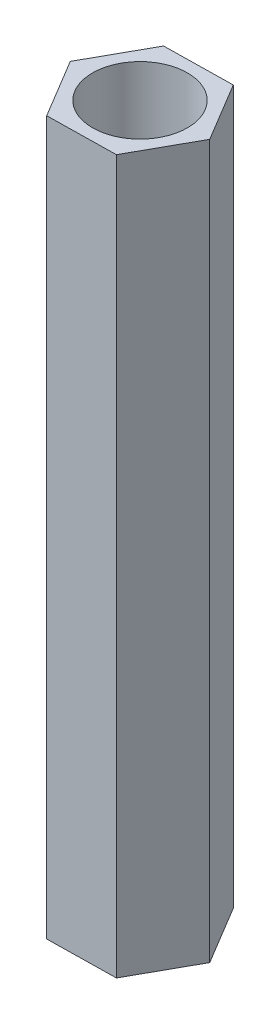
ISO-10303-21;
HEADER;
FILE_DESCRIPTION(('STEP AP214'),'2;1');
FILE_NAME('part.step','',(''),(''),'','','');
FILE_SCHEMA(('AUTOMOTIVE_DESIGN { 1 0 10303 214 1 1 1 1 }'));
ENDSEC;
DATA;
#1=APPLICATION_CONTEXT('core data for automotive mechanical design processes');
#2=APPLICATION_PROTOCOL_DEFINITION('international standard','automotive_design',2000,#1);
#3=PRODUCT_CONTEXT('',#1,'mechanical');
#4=PRODUCT('Part','Part','',(#3));
#5=PRODUCT_RELATED_PRODUCT_CATEGORY('part','',(#4));
#6=PRODUCT_DEFINITION_FORMATION('','',#4);
#7=PRODUCT_DEFINITION_CONTEXT('part definition',#1,'design');
#8=PRODUCT_DEFINITION('design','',#6,#7);
#9=PRODUCT_DEFINITION_SHAPE('','',#8);
#10=(LENGTH_UNIT() NAMED_UNIT(*) SI_UNIT(.MILLI.,.METRE.));
#11=(NAMED_UNIT(*) PLANE_ANGLE_UNIT() SI_UNIT($,.RADIAN.));
#12=(NAMED_UNIT(*) SI_UNIT($,.STERADIAN.) SOLID_ANGLE_UNIT());
#13=UNCERTAINTY_MEASURE_WITH_UNIT(LENGTH_MEASURE(1.E-05),#10,'distance_accuracy_value','');
#14=(GEOMETRIC_REPRESENTATION_CONTEXT(3) GLOBAL_UNCERTAINTY_ASSIGNED_CONTEXT((#13)) GLOBAL_UNIT_ASSIGNED_CONTEXT((#10,
#11,#12)) REPRESENTATION_CONTEXT('',''));
#15=CARTESIAN_POINT('',(0.,0.,0.));
#16=DIRECTION('',(0.,0.,1.));
#17=DIRECTION('',(1.,0.,0.));
#18=AXIS2_PLACEMENT_3D('',#15,#16,#17);
#19=CARTESIAN_POINT('',(0.,30.,0.));
#20=DIRECTION('',(0.,1.,0.));
#21=DIRECTION('',(0.,0.,1.));
#22=AXIS2_PLACEMENT_3D('',#19,#20,#21);
#23=PLANE('',#22);
#24=DIRECTION('',(-0.51422094243495,0.,-0.857657753629798));
#25=VECTOR('',#24,1.);
#26=CARTESIAN_POINT('',(2.88635838291889,30.,-0.0476300187605399));
#27=LINE('',#26,#25);
#28=CARTESIAN_POINT('',(2.88635838291889,30.,-0.0476300187605399));
#29=VERTEX_POINT('',#28);
#30=CARTESIAN_POINT('',(1.40193038523009,30.,-2.52347469341419));
#31=VERTEX_POINT('',#30);
#32=EDGE_CURVE('E132',#29,#31,#27,.T.);
#33=ORIENTED_EDGE('',*,*,#32,.T.);
#34=DIRECTION('',(-0.999863873613576,0.,0.0164995224917422));
#35=VECTOR('',#34,1.);
#36=CARTESIAN_POINT('',(1.40193038523009,30.,-2.52347469341419));
#37=LINE('',#36,#35);
#38=CARTESIAN_POINT('',(-1.4844279976888,30.,-2.47584467465366));
#39=VERTEX_POINT('',#38);
#40=EDGE_CURVE('E90',#31,#39,#37,.T.);
#41=ORIENTED_EDGE('',*,*,#40,.T.);
#42=DIRECTION('',(-0.485642931178626,0.,0.874157276121541));
#43=VECTOR('',#42,1.);
#44=CARTESIAN_POINT('',(-1.4844279976888,30.,-2.47584467465366));
#45=LINE('',#44,#43);
#46=CARTESIAN_POINT('',(-2.88635838291888,30.,0.0476300187605347));
#47=VERTEX_POINT('',#46);
#48=EDGE_CURVE('E103',#39,#47,#45,.T.);
#49=ORIENTED_EDGE('',*,*,#48,.T.);
#50=DIRECTION('',(0.51422094243495,0.,0.857657753629798));
#51=VECTOR('',#50,1.);
#52=CARTESIAN_POINT('',(-2.88635838291888,30.,0.0476300187605347));
#53=LINE('',#52,#51);
#54=CARTESIAN_POINT('',(-1.40193038523008,30.,2.5234746934142));
#55=VERTEX_POINT('',#54);
#56=EDGE_CURVE('E97',#47,#55,#53,.T.);
#57=ORIENTED_EDGE('',*,*,#56,.T.);
#58=DIRECTION('',(0.999863873613576,0.,-0.0164995224917429));
#59=VECTOR('',#58,1.);
#60=CARTESIAN_POINT('',(-1.40193038523008,30.,2.5234746934142));
#61=LINE('',#60,#59);
#62=CARTESIAN_POINT('',(1.4844279976888,30.,2.47584467465366));
#63=VERTEX_POINT('',#62);
#64=EDGE_CURVE('E101',#55,#63,#61,.T.);
#65=ORIENTED_EDGE('',*,*,#64,.T.);
#66=DIRECTION('',(0.485642931178626,0.,-0.874157276121541));
#67=VECTOR('',#66,1.);
#68=CARTESIAN_POINT('',(1.4844279976888,30.,2.47584467465366));
#69=LINE('',#68,#67);
#70=EDGE_CURVE('E53',#63,#29,#69,.T.);
#71=ORIENTED_EDGE('',*,*,#70,.T.);
#72=EDGE_LOOP('',(#33,#41,#49,#57,#65,#71));
#73=FACE_BOUND('',#72,.T.);
#74=CARTESIAN_POINT('',(0.,30.,0.));
#75=DIRECTION('',(0.,1.,0.));
#76=DIRECTION('',(0.,0.,1.));
#77=AXIS2_PLACEMENT_3D('',#74,#75,#76);
#78=CIRCLE('',#77,2.);
#79=CARTESIAN_POINT('',(0.,30.,2.));
#80=VERTEX_POINT('',#79);
#81=EDGE_CURVE('E125',#80,#80,#78,.T.);
#82=ORIENTED_EDGE('',*,*,#81,.F.);
#83=EDGE_LOOP('',(#82));
#84=FACE_BOUND('',#83,.T.);
#85=ADVANCED_FACE('F36',(#73,#84),#23,.T.);
#86=CARTESIAN_POINT('',(0.,0.,0.));
#87=DIRECTION('',(0.,1.,0.));
#88=DIRECTION('',(0.,0.,1.));
#89=AXIS2_PLACEMENT_3D('',#86,#87,#88);
#90=PLANE('',#89);
#91=DIRECTION('',(-0.51422094243495,0.,-0.857657753629798));
#92=VECTOR('',#91,1.);
#93=CARTESIAN_POINT('',(2.88635838291889,0.,-0.0476300187605399));
#94=LINE('',#93,#92);
#95=CARTESIAN_POINT('',(2.88635838291889,0.,-0.0476300187605399));
#96=VERTEX_POINT('',#95);
#97=CARTESIAN_POINT('',(1.40193038523009,0.,-2.52347469341419));
#98=VERTEX_POINT('',#97);
#99=EDGE_CURVE('E121',#96,#98,#94,.T.);
#100=ORIENTED_EDGE('',*,*,#99,.F.);
#101=DIRECTION('',(0.485642931178626,0.,-0.874157276121541));
#102=VECTOR('',#101,1.);
#103=CARTESIAN_POINT('',(1.4844279976888,0.,2.47584467465366));
#104=LINE('',#103,#102);
#105=CARTESIAN_POINT('',(1.4844279976888,0.,2.47584467465366));
#106=VERTEX_POINT('',#105);
#107=EDGE_CURVE('E82',#106,#96,#104,.T.);
#108=ORIENTED_EDGE('',*,*,#107,.F.);
#109=DIRECTION('',(0.999863873613576,0.,-0.0164995224917429));
#110=VECTOR('',#109,1.);
#111=CARTESIAN_POINT('',(-1.40193038523008,0.,2.5234746934142));
#112=LINE('',#111,#110);
#113=CARTESIAN_POINT('',(-1.40193038523008,0.,2.5234746934142));
#114=VERTEX_POINT('',#113);
#115=EDGE_CURVE('E76',#114,#106,#112,.T.);
#116=ORIENTED_EDGE('',*,*,#115,.F.);
#117=DIRECTION('',(0.51422094243495,0.,0.857657753629798));
#118=VECTOR('',#117,1.);
#119=CARTESIAN_POINT('',(-2.88635838291888,0.,0.0476300187605347));
#120=LINE('',#119,#118);
#121=CARTESIAN_POINT('',(-2.88635838291888,0.,0.0476300187605347));
#122=VERTEX_POINT('',#121);
#123=EDGE_CURVE('E111',#122,#114,#120,.T.);
#124=ORIENTED_EDGE('',*,*,#123,.F.);
#125=DIRECTION('',(-0.485642931178626,0.,0.874157276121541));
#126=VECTOR('',#125,1.);
#127=CARTESIAN_POINT('',(-1.4844279976888,0.,-2.47584467465366));
#128=LINE('',#127,#126);
#129=CARTESIAN_POINT('',(-1.4844279976888,0.,-2.47584467465366));
#130=VERTEX_POINT('',#129);
#131=EDGE_CURVE('E127',#130,#122,#128,.T.);
#132=ORIENTED_EDGE('',*,*,#131,.F.);
#133=DIRECTION('',(-0.999863873613576,0.,0.0164995224917422));
#134=VECTOR('',#133,1.);
#135=CARTESIAN_POINT('',(1.40193038523009,0.,-2.52347469341419));
#136=LINE('',#135,#134);
#137=EDGE_CURVE('E124',#98,#130,#136,.T.);
#138=ORIENTED_EDGE('',*,*,#137,.F.);
#139=EDGE_LOOP('',(#100,#108,#116,#124,#132,#138));
#140=FACE_BOUND('',#139,.T.);
#141=CARTESIAN_POINT('',(0.,0.,0.));
#142=DIRECTION('',(0.,1.,0.));
#143=DIRECTION('',(0.,0.,1.));
#144=AXIS2_PLACEMENT_3D('',#141,#142,#143);
#145=CIRCLE('',#144,2.);
#146=CARTESIAN_POINT('',(0.,0.,2.));
#147=VERTEX_POINT('',#146);
#148=EDGE_CURVE('E243',#147,#147,#145,.T.);
#149=ORIENTED_EDGE('',*,*,#148,.T.);
#150=EDGE_LOOP('',(#149));
#151=FACE_BOUND('',#150,.T.);
#152=ADVANCED_FACE('F141',(#140,#151),#90,.F.);
#153=CARTESIAN_POINT('',(2.88635838291889,30.,-0.0476300187605399));
#154=DIRECTION('',(-0.857657753629798,0.,0.51422094243495));
#155=DIRECTION('',(0.51422094243495,0.,0.857657753629799));
#156=AXIS2_PLACEMENT_3D('',#153,#154,#155);
#157=PLANE('',#156);
#158=ORIENTED_EDGE('',*,*,#99,.T.);
#159=DIRECTION('',(0.,-1.,0.));
#160=VECTOR('',#159,1.);
#161=CARTESIAN_POINT('',(1.40193038523009,30.,-2.52347469341419));
#162=LINE('',#161,#160);
#163=EDGE_CURVE('E11',#31,#98,#162,.T.);
#164=ORIENTED_EDGE('',*,*,#163,.F.);
#165=ORIENTED_EDGE('',*,*,#32,.F.);
#166=DIRECTION('',(0.,-1.,0.));
#167=VECTOR('',#166,1.);
#168=CARTESIAN_POINT('',(2.88635838291889,30.,-0.0476300187605399));
#169=LINE('',#168,#167);
#170=EDGE_CURVE('E117',#29,#96,#169,.T.);
#171=ORIENTED_EDGE('',*,*,#170,.T.);
#172=EDGE_LOOP('',(#158,#164,#165,#171));
#173=FACE_BOUND('',#172,.T.);
#174=ADVANCED_FACE('F38',(#173),#157,.F.);
#175=CARTESIAN_POINT('',(1.40193038523009,30.,-2.52347469341419));
#176=DIRECTION('',(0.0164995224917422,0.,0.999863873613576));
#177=DIRECTION('',(0.999863873613576,0.,-0.0164995224917423));
#178=AXIS2_PLACEMENT_3D('',#175,#176,#177);
#179=PLANE('',#178);
#180=ORIENTED_EDGE('',*,*,#137,.T.);
#181=DIRECTION('',(0.,-1.,0.));
#182=VECTOR('',#181,1.);
#183=CARTESIAN_POINT('',(-1.4844279976888,30.,-2.47584467465366));
#184=LINE('',#183,#182);
#185=EDGE_CURVE('E45',#39,#130,#184,.T.);
#186=ORIENTED_EDGE('',*,*,#185,.F.);
#187=ORIENTED_EDGE('',*,*,#40,.F.);
#188=ORIENTED_EDGE('',*,*,#163,.T.);
#189=EDGE_LOOP('',(#180,#186,#187,#188));
#190=FACE_BOUND('',#189,.T.);
#191=ADVANCED_FACE('F166',(#190),#179,.F.);
#192=CARTESIAN_POINT('',(-1.4844279976888,30.,-2.47584467465366));
#193=DIRECTION('',(0.874157276121541,0.,0.485642931178626));
#194=DIRECTION('',(0.485642931178626,0.,-0.874157276121541));
#195=AXIS2_PLACEMENT_3D('',#192,#193,#194);
#196=PLANE('',#195);
#197=ORIENTED_EDGE('',*,*,#131,.T.);
#198=DIRECTION('',(0.,-1.,0.));
#199=VECTOR('',#198,1.);
#200=CARTESIAN_POINT('',(-2.88635838291888,30.,0.0476300187605347));
#201=LINE('',#200,#199);
#202=EDGE_CURVE('E112',#47,#122,#201,.T.);
#203=ORIENTED_EDGE('',*,*,#202,.F.);
#204=ORIENTED_EDGE('',*,*,#48,.F.);
#205=ORIENTED_EDGE('',*,*,#185,.T.);
#206=EDGE_LOOP('',(#197,#203,#204,#205));
#207=FACE_BOUND('',#206,.T.);
#208=ADVANCED_FACE('F138',(#207),#196,.F.);
#209=CARTESIAN_POINT('',(-2.88635838291888,30.,0.0476300187605347));
#210=DIRECTION('',(0.857657753629798,0.,-0.51422094243495));
#211=DIRECTION('',(-0.51422094243495,0.,-0.857657753629798));
#212=AXIS2_PLACEMENT_3D('',#209,#210,#211);
#213=PLANE('',#212);
#214=ORIENTED_EDGE('',*,*,#123,.T.);
#215=DIRECTION('',(0.,-1.,0.));
#216=VECTOR('',#215,1.);
#217=CARTESIAN_POINT('',(-1.40193038523008,30.,2.5234746934142));
#218=LINE('',#217,#216);
#219=EDGE_CURVE('E108',#55,#114,#218,.T.);
#220=ORIENTED_EDGE('',*,*,#219,.F.);
#221=ORIENTED_EDGE('',*,*,#56,.F.);
#222=ORIENTED_EDGE('',*,*,#202,.T.);
#223=EDGE_LOOP('',(#214,#220,#221,#222));
#224=FACE_BOUND('',#223,.T.);
#225=ADVANCED_FACE('F109',(#224),#213,.F.);
#226=CARTESIAN_POINT('',(-1.40193038523008,30.,2.5234746934142));
#227=DIRECTION('',(-0.0164995224917429,0.,-0.999863873613576));
#228=DIRECTION('',(-0.999863873613576,0.,0.0164995224917429));
#229=AXIS2_PLACEMENT_3D('',#226,#227,#228);
#230=PLANE('',#229);
#231=ORIENTED_EDGE('',*,*,#115,.T.);
#232=DIRECTION('',(0.,-1.,0.));
#233=VECTOR('',#232,1.);
#234=CARTESIAN_POINT('',(1.4844279976888,30.,2.47584467465366));
#235=LINE('',#234,#233);
#236=EDGE_CURVE('E113',#63,#106,#235,.T.);
#237=ORIENTED_EDGE('',*,*,#236,.F.);
#238=ORIENTED_EDGE('',*,*,#64,.F.);
#239=ORIENTED_EDGE('',*,*,#219,.T.);
#240=EDGE_LOOP('',(#231,#237,#238,#239));
#241=FACE_BOUND('',#240,.T.);
#242=ADVANCED_FACE('F115',(#241),#230,.F.);
#243=CARTESIAN_POINT('',(1.4844279976888,30.,2.47584467465366));
#244=DIRECTION('',(-0.874157276121541,0.,-0.485642931178626));
#245=DIRECTION('',(-0.485642931178626,0.,0.874157276121541));
#246=AXIS2_PLACEMENT_3D('',#243,#244,#245);
#247=PLANE('',#246);
#248=ORIENTED_EDGE('',*,*,#107,.T.);
#249=ORIENTED_EDGE('',*,*,#170,.F.);
#250=ORIENTED_EDGE('',*,*,#70,.F.);
#251=ORIENTED_EDGE('',*,*,#236,.T.);
#252=EDGE_LOOP('',(#248,#249,#250,#251));
#253=FACE_BOUND('',#252,.T.);
#254=ADVANCED_FACE('F146',(#253),#247,.F.);
#255=CARTESIAN_POINT('',(0.,30.,0.));
#256=DIRECTION('',(0.,-1.,0.));
#257=DIRECTION('',(0.,0.,-1.));
#258=AXIS2_PLACEMENT_3D('',#255,#256,#257);
#259=CYLINDRICAL_SURFACE('',#258,2.);
#260=ORIENTED_EDGE('',*,*,#81,.T.);
#261=EDGE_LOOP('',(#260));
#262=FACE_BOUND('',#261,.T.);
#263=ORIENTED_EDGE('',*,*,#148,.F.);
#264=EDGE_LOOP('',(#263));
#265=FACE_BOUND('',#264,.T.);
#266=ADVANCED_FACE('F148',(#262,#265),#259,.F.);
#267=CLOSED_SHELL('',(#85,#152,#174,#191,#208,#225,#242,#254,#266));
#268=MANIFOLD_SOLID_BREP('B2',#267);
#269=ADVANCED_BREP_SHAPE_REPRESENTATION('',(#18,#268),#14);
#270=SHAPE_DEFINITION_REPRESENTATION(#9,#269);
ENDSEC;
END-ISO-10303-21;
